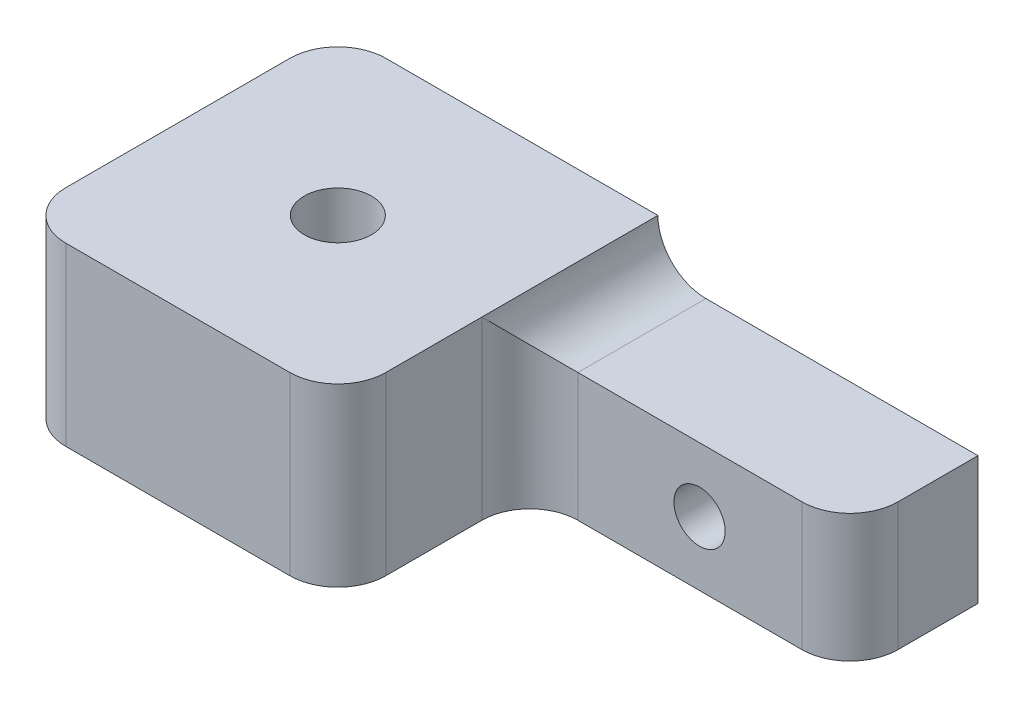
ISO-10303-21;
HEADER;
FILE_DESCRIPTION(('STEP AP214'),'2;1');
FILE_NAME('part.step','',(''),(''),'','','');
FILE_SCHEMA(('AUTOMOTIVE_DESIGN { 1 0 10303 214 1 1 1 1 }'));
ENDSEC;
DATA;
#1=APPLICATION_CONTEXT('core data for automotive mechanical design processes');
#2=APPLICATION_PROTOCOL_DEFINITION('international standard','automotive_design',2000,#1);
#3=PRODUCT_CONTEXT('',#1,'mechanical');
#4=PRODUCT('Part','Part','',(#3));
#5=PRODUCT_RELATED_PRODUCT_CATEGORY('part','',(#4));
#6=PRODUCT_DEFINITION_FORMATION('','',#4);
#7=PRODUCT_DEFINITION_CONTEXT('part definition',#1,'design');
#8=PRODUCT_DEFINITION('design','',#6,#7);
#9=PRODUCT_DEFINITION_SHAPE('','',#8);
#10=(LENGTH_UNIT() NAMED_UNIT(*) SI_UNIT(.MILLI.,.METRE.));
#11=(NAMED_UNIT(*) PLANE_ANGLE_UNIT() SI_UNIT($,.RADIAN.));
#12=(NAMED_UNIT(*) SI_UNIT($,.STERADIAN.) SOLID_ANGLE_UNIT());
#13=UNCERTAINTY_MEASURE_WITH_UNIT(LENGTH_MEASURE(1.E-05),#10,'distance_accuracy_value','');
#14=(GEOMETRIC_REPRESENTATION_CONTEXT(3) GLOBAL_UNCERTAINTY_ASSIGNED_CONTEXT((#13)) GLOBAL_UNIT_ASSIGNED_CONTEXT((#10,
#11,#12)) REPRESENTATION_CONTEXT('',''));
#15=CARTESIAN_POINT('',(0.,0.,0.));
#16=DIRECTION('',(0.,0.,1.));
#17=DIRECTION('',(1.,0.,0.));
#18=AXIS2_PLACEMENT_3D('',#15,#16,#17);
#19=CARTESIAN_POINT('',(0.,8.,8.));
#20=DIRECTION('',(0.,-1.,0.));
#21=DIRECTION('',(0.,0.,-1.));
#22=AXIS2_PLACEMENT_3D('',#19,#20,#21);
#23=PLANE('',#22);
#24=DIRECTION('',(-1.,0.,0.));
#25=VECTOR('',#24,1.);
#26=CARTESIAN_POINT('',(0.,8.,8.));
#27=LINE('',#26,#25);
#28=CARTESIAN_POINT('',(37.,8.,8.));
#29=VERTEX_POINT('',#28);
#30=CARTESIAN_POINT('',(23.,8.,8.));
#31=VERTEX_POINT('',#30);
#32=EDGE_CURVE('E194',#29,#31,#27,.T.);
#33=ORIENTED_EDGE('',*,*,#32,.F.);
#34=CARTESIAN_POINT('',(37.,8.,5.));
#35=DIRECTION('',(0.,-1.,0.));
#36=DIRECTION('',(0.,0.,-1.));
#37=AXIS2_PLACEMENT_3D('',#34,#35,#36);
#38=CIRCLE('',#37,3.);
#39=CARTESIAN_POINT('',(40.,8.,5.));
#40=VERTEX_POINT('',#39);
#41=EDGE_CURVE('E57',#29,#40,#38,.F.);
#42=ORIENTED_EDGE('',*,*,#41,.T.);
#43=DIRECTION('',(0.,0.,-1.));
#44=VECTOR('',#43,1.);
#45=CARTESIAN_POINT('',(40.,8.,8.));
#46=LINE('',#45,#44);
#47=CARTESIAN_POINT('',(40.,8.,0.));
#48=VERTEX_POINT('',#47);
#49=EDGE_CURVE('E205',#40,#48,#46,.T.);
#50=ORIENTED_EDGE('',*,*,#49,.T.);
#51=DIRECTION('',(-1.,0.,0.));
#52=VECTOR('',#51,1.);
#53=CARTESIAN_POINT('',(0.,8.,0.));
#54=LINE('',#53,#52);
#55=CARTESIAN_POINT('',(23.,8.,0.));
#56=VERTEX_POINT('',#55);
#57=EDGE_CURVE('E195',#48,#56,#54,.T.);
#58=ORIENTED_EDGE('',*,*,#57,.T.);
#59=DIRECTION('',(0.,0.,-1.));
#60=VECTOR('',#59,1.);
#61=CARTESIAN_POINT('',(23.,8.,8.));
#62=LINE('',#61,#60);
#63=EDGE_CURVE('E145',#56,#31,#62,.F.);
#64=ORIENTED_EDGE('',*,*,#63,.T.);
#65=EDGE_LOOP('',(#33,#42,#50,#58,#64));
#66=FACE_BOUND('',#65,.T.);
#67=ADVANCED_FACE('F35',(#66),#23,.F.);
#68=CARTESIAN_POINT('',(0.,0.,8.));
#69=DIRECTION('',(0.,0.,-1.));
#70=DIRECTION('',(-1.,0.,0.));
#71=AXIS2_PLACEMENT_3D('',#68,#69,#70);
#72=PLANE('',#71);
#73=CARTESIAN_POINT('',(30.6,4.,8.));
#74=DIRECTION('',(0.,0.,-1.));
#75=DIRECTION('',(-1.,0.,0.));
#76=AXIS2_PLACEMENT_3D('',#73,#74,#75);
#77=CIRCLE('',#76,1.6);
#78=CARTESIAN_POINT('',(29.,4.,8.));
#79=VERTEX_POINT('',#78);
#80=EDGE_CURVE('E430',#79,#79,#77,.T.);
#81=ORIENTED_EDGE('',*,*,#80,.T.);
#82=EDGE_LOOP('',(#81));
#83=FACE_BOUND('',#82,.T.);
#84=DIRECTION('',(1.,0.,0.));
#85=VECTOR('',#84,1.);
#86=CARTESIAN_POINT('',(0.,0.,8.));
#87=LINE('',#86,#85);
#88=CARTESIAN_POINT('',(23.,0.,8.));
#89=VERTEX_POINT('',#88);
#90=CARTESIAN_POINT('',(37.,0.,8.));
#91=VERTEX_POINT('',#90);
#92=EDGE_CURVE('E172',#89,#91,#87,.T.);
#93=ORIENTED_EDGE('',*,*,#92,.T.);
#94=DIRECTION('',(0.,1.,0.));
#95=VECTOR('',#94,1.);
#96=CARTESIAN_POINT('',(37.,0.,8.));
#97=LINE('',#96,#95);
#98=EDGE_CURVE('E147',#91,#29,#97,.T.);
#99=ORIENTED_EDGE('',*,*,#98,.T.);
#100=ORIENTED_EDGE('',*,*,#32,.T.);
#101=DIRECTION('',(0.,1.,0.));
#102=VECTOR('',#101,1.);
#103=CARTESIAN_POINT('',(23.,0.,8.));
#104=LINE('',#103,#102);
#105=EDGE_CURVE('E152',#31,#89,#104,.F.);
#106=ORIENTED_EDGE('',*,*,#105,.T.);
#107=EDGE_LOOP('',(#93,#99,#100,#106));
#108=FACE_BOUND('',#107,.T.);
#109=ADVANCED_FACE('F256',(#83,#108),#72,.F.);
#110=CARTESIAN_POINT('',(0.,0.,8.));
#111=DIRECTION('',(1.,0.,0.));
#112=DIRECTION('',(0.,0.,-1.));
#113=AXIS2_PLACEMENT_3D('',#110,#111,#112);
#114=PLANE('',#113);
#115=DIRECTION('',(0.,0.,1.));
#116=VECTOR('',#115,1.);
#117=CARTESIAN_POINT('',(0.,11.,20.));
#118=LINE('',#117,#116);
#119=CARTESIAN_POINT('',(0.,11.,3.));
#120=VERTEX_POINT('',#119);
#121=CARTESIAN_POINT('',(0.,11.,17.));
#122=VERTEX_POINT('',#121);
#123=EDGE_CURVE('E432',#120,#122,#118,.T.);
#124=ORIENTED_EDGE('',*,*,#123,.F.);
#125=DIRECTION('',(0.,-1.,0.));
#126=VECTOR('',#125,1.);
#127=CARTESIAN_POINT('',(0.,0.,3.));
#128=LINE('',#127,#126);
#129=CARTESIAN_POINT('',(0.,0.,3.));
#130=VERTEX_POINT('',#129);
#131=EDGE_CURVE('E159',#120,#130,#128,.T.);
#132=ORIENTED_EDGE('',*,*,#131,.T.);
#133=DIRECTION('',(0.,0.,-1.));
#134=VECTOR('',#133,1.);
#135=CARTESIAN_POINT('',(0.,0.,8.));
#136=LINE('',#135,#134);
#137=CARTESIAN_POINT('',(0.,0.,17.));
#138=VERTEX_POINT('',#137);
#139=EDGE_CURVE('E218',#138,#130,#136,.T.);
#140=ORIENTED_EDGE('',*,*,#139,.F.);
#141=DIRECTION('',(0.,-1.,0.));
#142=VECTOR('',#141,1.);
#143=CARTESIAN_POINT('',(0.,11.,17.));
#144=LINE('',#143,#142);
#145=EDGE_CURVE('E157',#138,#122,#144,.F.);
#146=ORIENTED_EDGE('',*,*,#145,.T.);
#147=EDGE_LOOP('',(#124,#132,#140,#146));
#148=FACE_BOUND('',#147,.T.);
#149=ADVANCED_FACE('F225',(#148),#114,.F.);
#150=CARTESIAN_POINT('',(0.,0.,8.));
#151=DIRECTION('',(0.,1.,0.));
#152=DIRECTION('',(0.,0.,1.));
#153=AXIS2_PLACEMENT_3D('',#150,#151,#152);
#154=PLANE('',#153);
#155=CARTESIAN_POINT('',(10.,0.,10.));
#156=DIRECTION('',(0.,-1.,0.));
#157=DIRECTION('',(0.,0.,-1.));
#158=AXIS2_PLACEMENT_3D('',#155,#156,#157);
#159=CIRCLE('',#158,2.1);
#160=CARTESIAN_POINT('',(10.,0.,7.9));
#161=VERTEX_POINT('',#160);
#162=EDGE_CURVE('E423',#161,#161,#159,.T.);
#163=ORIENTED_EDGE('',*,*,#162,.F.);
#164=EDGE_LOOP('',(#163));
#165=FACE_BOUND('',#164,.T.);
#166=DIRECTION('',(0.,0.,-1.));
#167=VECTOR('',#166,1.);
#168=CARTESIAN_POINT('',(20.,0.,20.));
#169=LINE('',#168,#167);
#170=CARTESIAN_POINT('',(20.,0.,17.));
#171=VERTEX_POINT('',#170);
#172=CARTESIAN_POINT('',(20.,0.,11.));
#173=VERTEX_POINT('',#172);
#174=EDGE_CURVE('E169',#171,#173,#169,.T.);
#175=ORIENTED_EDGE('',*,*,#174,.F.);
#176=CARTESIAN_POINT('',(17.,0.,17.));
#177=DIRECTION('',(0.,1.,0.));
#178=DIRECTION('',(0.,0.,1.));
#179=AXIS2_PLACEMENT_3D('',#176,#177,#178);
#180=CIRCLE('',#179,3.);
#181=CARTESIAN_POINT('',(17.,0.,20.));
#182=VERTEX_POINT('',#181);
#183=EDGE_CURVE('E206',#171,#182,#180,.F.);
#184=ORIENTED_EDGE('',*,*,#183,.T.);
#185=DIRECTION('',(1.,0.,0.));
#186=VECTOR('',#185,1.);
#187=CARTESIAN_POINT('',(0.,0.,20.));
#188=LINE('',#187,#186);
#189=CARTESIAN_POINT('',(3.,0.,20.));
#190=VERTEX_POINT('',#189);
#191=EDGE_CURVE('E142',#190,#182,#188,.T.);
#192=ORIENTED_EDGE('',*,*,#191,.F.);
#193=CARTESIAN_POINT('',(3.,0.,17.));
#194=DIRECTION('',(0.,1.,0.));
#195=DIRECTION('',(0.,0.,1.));
#196=AXIS2_PLACEMENT_3D('',#193,#194,#195);
#197=CIRCLE('',#196,3.);
#198=EDGE_CURVE('E186',#190,#138,#197,.F.);
#199=ORIENTED_EDGE('',*,*,#198,.T.);
#200=ORIENTED_EDGE('',*,*,#139,.T.);
#201=CARTESIAN_POINT('',(3.,0.,3.));
#202=DIRECTION('',(0.,1.,0.));
#203=DIRECTION('',(0.,0.,1.));
#204=AXIS2_PLACEMENT_3D('',#201,#202,#203);
#205=CIRCLE('',#204,3.);
#206=CARTESIAN_POINT('',(3.,0.,0.));
#207=VERTEX_POINT('',#206);
#208=EDGE_CURVE('E212',#130,#207,#205,.F.);
#209=ORIENTED_EDGE('',*,*,#208,.T.);
#210=DIRECTION('',(1.,0.,0.));
#211=VECTOR('',#210,1.);
#212=CARTESIAN_POINT('',(0.,0.,0.));
#213=LINE('',#212,#211);
#214=CARTESIAN_POINT('',(40.,0.,0.));
#215=VERTEX_POINT('',#214);
#216=EDGE_CURVE('E181',#207,#215,#213,.T.);
#217=ORIENTED_EDGE('',*,*,#216,.T.);
#218=DIRECTION('',(0.,0.,-1.));
#219=VECTOR('',#218,1.);
#220=CARTESIAN_POINT('',(40.,0.,8.));
#221=LINE('',#220,#219);
#222=CARTESIAN_POINT('',(40.,0.,5.));
#223=VERTEX_POINT('',#222);
#224=EDGE_CURVE('E229',#223,#215,#221,.T.);
#225=ORIENTED_EDGE('',*,*,#224,.F.);
#226=CARTESIAN_POINT('',(37.,0.,5.));
#227=DIRECTION('',(0.,1.,0.));
#228=DIRECTION('',(0.,0.,1.));
#229=AXIS2_PLACEMENT_3D('',#226,#227,#228);
#230=CIRCLE('',#229,3.);
#231=EDGE_CURVE('E209',#223,#91,#230,.F.);
#232=ORIENTED_EDGE('',*,*,#231,.T.);
#233=ORIENTED_EDGE('',*,*,#92,.F.);
#234=CARTESIAN_POINT('',(23.,0.,11.));
#235=DIRECTION('',(0.,1.,0.));
#236=DIRECTION('',(0.,0.,1.));
#237=AXIS2_PLACEMENT_3D('',#234,#235,#236);
#238=CIRCLE('',#237,3.);
#239=EDGE_CURVE('E44',#89,#173,#238,.T.);
#240=ORIENTED_EDGE('',*,*,#239,.T.);
#241=EDGE_LOOP('',(#175,#184,#192,#199,#200,#209,#217,#225,#232,#233,#240));
#242=FACE_BOUND('',#241,.T.);
#243=ADVANCED_FACE('F168',(#165,#242),#154,.F.);
#244=CARTESIAN_POINT('',(40.,0.,8.));
#245=DIRECTION('',(-1.,0.,0.));
#246=DIRECTION('',(0.,0.,1.));
#247=AXIS2_PLACEMENT_3D('',#244,#245,#246);
#248=PLANE('',#247);
#249=ORIENTED_EDGE('',*,*,#49,.F.);
#250=DIRECTION('',(0.,1.,0.));
#251=VECTOR('',#250,1.);
#252=CARTESIAN_POINT('',(40.,0.,5.));
#253=LINE('',#252,#251);
#254=EDGE_CURVE('E149',#40,#223,#253,.F.);
#255=ORIENTED_EDGE('',*,*,#254,.T.);
#256=ORIENTED_EDGE('',*,*,#224,.T.);
#257=DIRECTION('',(0.,1.,0.));
#258=VECTOR('',#257,1.);
#259=CARTESIAN_POINT('',(40.,0.,0.));
#260=LINE('',#259,#258);
#261=EDGE_CURVE('E243',#215,#48,#260,.T.);
#262=ORIENTED_EDGE('',*,*,#261,.T.);
#263=EDGE_LOOP('',(#249,#255,#256,#262));
#264=FACE_BOUND('',#263,.T.);
#265=ADVANCED_FACE('F250',(#264),#248,.F.);
#266=CARTESIAN_POINT('',(0.,0.,0.));
#267=DIRECTION('',(0.,0.,-1.));
#268=DIRECTION('',(-1.,0.,0.));
#269=AXIS2_PLACEMENT_3D('',#266,#267,#268);
#270=PLANE('',#269);
#271=CARTESIAN_POINT('',(30.6,4.,0.));
#272=DIRECTION('',(0.,0.,-1.));
#273=DIRECTION('',(-1.,0.,0.));
#274=AXIS2_PLACEMENT_3D('',#271,#272,#273);
#275=CIRCLE('',#274,1.6);
#276=CARTESIAN_POINT('',(29.,4.,0.));
#277=VERTEX_POINT('',#276);
#278=EDGE_CURVE('E425',#277,#277,#275,.T.);
#279=ORIENTED_EDGE('',*,*,#278,.F.);
#280=EDGE_LOOP('',(#279));
#281=FACE_BOUND('',#280,.T.);
#282=ORIENTED_EDGE('',*,*,#216,.F.);
#283=DIRECTION('',(0.,-1.,0.));
#284=VECTOR('',#283,1.);
#285=CARTESIAN_POINT('',(3.,11.,0.));
#286=LINE('',#285,#284);
#287=CARTESIAN_POINT('',(3.,11.,0.));
#288=VERTEX_POINT('',#287);
#289=EDGE_CURVE('E141',#207,#288,#286,.F.);
#290=ORIENTED_EDGE('',*,*,#289,.T.);
#291=DIRECTION('',(-1.,0.,0.));
#292=VECTOR('',#291,1.);
#293=CARTESIAN_POINT('',(0.,11.,0.));
#294=LINE('',#293,#292);
#295=CARTESIAN_POINT('',(20.,11.,0.));
#296=VERTEX_POINT('',#295);
#297=EDGE_CURVE('E129',#296,#288,#294,.T.);
#298=ORIENTED_EDGE('',*,*,#297,.F.);
#299=CARTESIAN_POINT('',(23.,11.,0.));
#300=DIRECTION('',(0.,0.,-1.));
#301=DIRECTION('',(-1.,0.,0.));
#302=AXIS2_PLACEMENT_3D('',#299,#300,#301);
#303=CIRCLE('',#302,3.);
#304=EDGE_CURVE('E11',#296,#56,#303,.F.);
#305=ORIENTED_EDGE('',*,*,#304,.T.);
#306=ORIENTED_EDGE('',*,*,#57,.F.);
#307=ORIENTED_EDGE('',*,*,#261,.F.);
#308=EDGE_LOOP('',(#282,#290,#298,#305,#306,#307));
#309=FACE_BOUND('',#308,.T.);
#310=ADVANCED_FACE('F139',(#281,#309),#270,.T.);
#311=CARTESIAN_POINT('',(20.,8.,20.));
#312=DIRECTION('',(-1.,0.,0.));
#313=DIRECTION('',(0.,0.,1.));
#314=AXIS2_PLACEMENT_3D('',#311,#312,#313);
#315=PLANE('',#314);
#316=DIRECTION('',(0.,0.,-1.));
#317=VECTOR('',#316,1.);
#318=CARTESIAN_POINT('',(20.,11.,20.));
#319=LINE('',#318,#317);
#320=CARTESIAN_POINT('',(20.,11.,17.));
#321=VERTEX_POINT('',#320);
#322=CARTESIAN_POINT('',(20.,11.,11.));
#323=VERTEX_POINT('',#322);
#324=EDGE_CURVE('E132',#321,#323,#319,.T.);
#325=ORIENTED_EDGE('',*,*,#324,.F.);
#326=DIRECTION('',(0.,1.,0.));
#327=VECTOR('',#326,1.);
#328=CARTESIAN_POINT('',(20.,0.,17.));
#329=LINE('',#328,#327);
#330=EDGE_CURVE('E180',#321,#171,#329,.F.);
#331=ORIENTED_EDGE('',*,*,#330,.T.);
#332=ORIENTED_EDGE('',*,*,#174,.T.);
#333=DIRECTION('',(0.,1.,0.));
#334=VECTOR('',#333,1.);
#335=CARTESIAN_POINT('',(20.,8.,11.));
#336=LINE('',#335,#334);
#337=EDGE_CURVE('E178',#173,#323,#336,.T.);
#338=ORIENTED_EDGE('',*,*,#337,.T.);
#339=EDGE_LOOP('',(#325,#331,#332,#338));
#340=FACE_BOUND('',#339,.T.);
#341=ADVANCED_FACE('F177',(#340),#315,.F.);
#342=CARTESIAN_POINT('',(0.,0.,20.));
#343=DIRECTION('',(0.,0.,1.));
#344=DIRECTION('',(1.,0.,0.));
#345=AXIS2_PLACEMENT_3D('',#342,#343,#344);
#346=PLANE('',#345);
#347=ORIENTED_EDGE('',*,*,#191,.T.);
#348=DIRECTION('',(0.,1.,0.));
#349=VECTOR('',#348,1.);
#350=CARTESIAN_POINT('',(17.,11.,20.));
#351=LINE('',#350,#349);
#352=CARTESIAN_POINT('',(17.,11.,20.));
#353=VERTEX_POINT('',#352);
#354=EDGE_CURVE('E235',#182,#353,#351,.T.);
#355=ORIENTED_EDGE('',*,*,#354,.T.);
#356=DIRECTION('',(1.,0.,0.));
#357=VECTOR('',#356,1.);
#358=CARTESIAN_POINT('',(0.,11.,20.));
#359=LINE('',#358,#357);
#360=CARTESIAN_POINT('',(3.,11.,20.));
#361=VERTEX_POINT('',#360);
#362=EDGE_CURVE('E136',#361,#353,#359,.T.);
#363=ORIENTED_EDGE('',*,*,#362,.F.);
#364=DIRECTION('',(0.,-1.,0.));
#365=VECTOR('',#364,1.);
#366=CARTESIAN_POINT('',(3.,0.,20.));
#367=LINE('',#366,#365);
#368=EDGE_CURVE('E228',#361,#190,#367,.T.);
#369=ORIENTED_EDGE('',*,*,#368,.T.);
#370=EDGE_LOOP('',(#347,#355,#363,#369));
#371=FACE_BOUND('',#370,.T.);
#372=ADVANCED_FACE('F323',(#371),#346,.T.);
#373=CARTESIAN_POINT('',(0.,11.,0.));
#374=DIRECTION('',(0.,-1.,0.));
#375=DIRECTION('',(0.,0.,-1.));
#376=AXIS2_PLACEMENT_3D('',#373,#374,#375);
#377=PLANE('',#376);
#378=CARTESIAN_POINT('',(10.,11.,10.));
#379=DIRECTION('',(0.,-1.,0.));
#380=DIRECTION('',(0.,0.,-1.));
#381=AXIS2_PLACEMENT_3D('',#378,#379,#380);
#382=CIRCLE('',#381,2.1);
#383=CARTESIAN_POINT('',(10.,11.,7.9));
#384=VERTEX_POINT('',#383);
#385=EDGE_CURVE('E420',#384,#384,#382,.T.);
#386=ORIENTED_EDGE('',*,*,#385,.T.);
#387=EDGE_LOOP('',(#386));
#388=FACE_BOUND('',#387,.T.);
#389=ORIENTED_EDGE('',*,*,#362,.T.);
#390=CARTESIAN_POINT('',(17.,11.,17.));
#391=DIRECTION('',(0.,-1.,0.));
#392=DIRECTION('',(0.,0.,-1.));
#393=AXIS2_PLACEMENT_3D('',#390,#391,#392);
#394=CIRCLE('',#393,3.);
#395=EDGE_CURVE('E184',#353,#321,#394,.F.);
#396=ORIENTED_EDGE('',*,*,#395,.T.);
#397=ORIENTED_EDGE('',*,*,#324,.T.);
#398=EDGE_CURVE('E126',#323,#296,#319,.T.);
#399=ORIENTED_EDGE('',*,*,#398,.T.);
#400=ORIENTED_EDGE('',*,*,#297,.T.);
#401=CARTESIAN_POINT('',(3.,11.,3.));
#402=DIRECTION('',(0.,-1.,0.));
#403=DIRECTION('',(0.,0.,-1.));
#404=AXIS2_PLACEMENT_3D('',#401,#402,#403);
#405=CIRCLE('',#404,3.);
#406=EDGE_CURVE('E188',#288,#120,#405,.F.);
#407=ORIENTED_EDGE('',*,*,#406,.T.);
#408=ORIENTED_EDGE('',*,*,#123,.T.);
#409=CARTESIAN_POINT('',(3.,11.,17.));
#410=DIRECTION('',(0.,-1.,0.));
#411=DIRECTION('',(0.,0.,-1.));
#412=AXIS2_PLACEMENT_3D('',#409,#410,#411);
#413=CIRCLE('',#412,3.);
#414=EDGE_CURVE('E233',#122,#361,#413,.F.);
#415=ORIENTED_EDGE('',*,*,#414,.T.);
#416=EDGE_LOOP('',(#389,#396,#397,#399,#400,#407,#408,#415));
#417=FACE_BOUND('',#416,.T.);
#418=ADVANCED_FACE('F128',(#388,#417),#377,.F.);
#419=CARTESIAN_POINT('',(17.,0.,17.));
#420=DIRECTION('',(0.,-1.,0.));
#421=DIRECTION('',(0.,0.,-1.));
#422=AXIS2_PLACEMENT_3D('',#419,#420,#421);
#423=CYLINDRICAL_SURFACE('',#422,3.);
#424=ORIENTED_EDGE('',*,*,#183,.F.);
#425=ORIENTED_EDGE('',*,*,#330,.F.);
#426=ORIENTED_EDGE('',*,*,#395,.F.);
#427=ORIENTED_EDGE('',*,*,#354,.F.);
#428=EDGE_LOOP('',(#424,#425,#426,#427));
#429=FACE_BOUND('',#428,.T.);
#430=ADVANCED_FACE('F278',(#429),#423,.T.);
#431=CARTESIAN_POINT('',(37.,0.,5.));
#432=DIRECTION('',(0.,1.,0.));
#433=DIRECTION('',(0.,0.,1.));
#434=AXIS2_PLACEMENT_3D('',#431,#432,#433);
#435=CYLINDRICAL_SURFACE('',#434,3.);
#436=ORIENTED_EDGE('',*,*,#231,.F.);
#437=ORIENTED_EDGE('',*,*,#254,.F.);
#438=ORIENTED_EDGE('',*,*,#41,.F.);
#439=ORIENTED_EDGE('',*,*,#98,.F.);
#440=EDGE_LOOP('',(#436,#437,#438,#439));
#441=FACE_BOUND('',#440,.T.);
#442=ADVANCED_FACE('F254',(#441),#435,.T.);
#443=CARTESIAN_POINT('',(3.,0.,3.));
#444=DIRECTION('',(0.,1.,0.));
#445=DIRECTION('',(0.,0.,1.));
#446=AXIS2_PLACEMENT_3D('',#443,#444,#445);
#447=CYLINDRICAL_SURFACE('',#446,3.);
#448=ORIENTED_EDGE('',*,*,#406,.F.);
#449=ORIENTED_EDGE('',*,*,#289,.F.);
#450=ORIENTED_EDGE('',*,*,#208,.F.);
#451=ORIENTED_EDGE('',*,*,#131,.F.);
#452=EDGE_LOOP('',(#448,#449,#450,#451));
#453=FACE_BOUND('',#452,.T.);
#454=ADVANCED_FACE('F284',(#453),#447,.T.);
#455=CARTESIAN_POINT('',(3.,0.,17.));
#456=DIRECTION('',(0.,1.,0.));
#457=DIRECTION('',(0.,0.,1.));
#458=AXIS2_PLACEMENT_3D('',#455,#456,#457);
#459=CYLINDRICAL_SURFACE('',#458,3.);
#460=ORIENTED_EDGE('',*,*,#414,.F.);
#461=ORIENTED_EDGE('',*,*,#145,.F.);
#462=ORIENTED_EDGE('',*,*,#198,.F.);
#463=ORIENTED_EDGE('',*,*,#368,.F.);
#464=EDGE_LOOP('',(#460,#461,#462,#463));
#465=FACE_BOUND('',#464,.T.);
#466=ADVANCED_FACE('F232',(#465),#459,.T.);
#467=CARTESIAN_POINT('',(23.,11.,20.));
#468=DIRECTION('',(0.,0.,1.));
#469=DIRECTION('',(1.,0.,0.));
#470=AXIS2_PLACEMENT_3D('',#467,#468,#469);
#471=CYLINDRICAL_SURFACE('',#470,3.);
#472=ORIENTED_EDGE('',*,*,#304,.F.);
#473=ORIENTED_EDGE('',*,*,#398,.F.);
#474=CARTESIAN_POINT('',(23.,11.,11.));
#475=DIRECTION('',(0.,-0.707106781186547,0.707106781186547));
#476=DIRECTION('',(0.,0.707106781186547,0.707106781186547));
#477=AXIS2_PLACEMENT_3D('',#474,#475,#476);
#478=ELLIPSE('',#477,4.24264068711928,3.);
#479=EDGE_CURVE('E39',#31,#323,#478,.F.);
#480=ORIENTED_EDGE('',*,*,#479,.F.);
#481=ORIENTED_EDGE('',*,*,#63,.F.);
#482=EDGE_LOOP('',(#472,#473,#480,#481));
#483=FACE_BOUND('',#482,.T.);
#484=ADVANCED_FACE('F37',(#483),#471,.F.);
#485=CARTESIAN_POINT('',(23.,8.,11.));
#486=DIRECTION('',(0.,-1.,0.));
#487=DIRECTION('',(0.,0.,-1.));
#488=AXIS2_PLACEMENT_3D('',#485,#486,#487);
#489=CYLINDRICAL_SURFACE('',#488,3.);
#490=ORIENTED_EDGE('',*,*,#239,.F.);
#491=ORIENTED_EDGE('',*,*,#105,.F.);
#492=ORIENTED_EDGE('',*,*,#479,.T.);
#493=ORIENTED_EDGE('',*,*,#337,.F.);
#494=EDGE_LOOP('',(#490,#491,#492,#493));
#495=FACE_BOUND('',#494,.T.);
#496=ADVANCED_FACE('F183',(#495),#489,.F.);
#497=CARTESIAN_POINT('',(30.6,4.,20.));
#498=DIRECTION('',(0.,0.,-1.));
#499=DIRECTION('',(-1.,0.,0.));
#500=AXIS2_PLACEMENT_3D('',#497,#498,#499);
#501=CYLINDRICAL_SURFACE('',#500,1.6);
#502=ORIENTED_EDGE('',*,*,#278,.T.);
#503=EDGE_LOOP('',(#502));
#504=FACE_BOUND('',#503,.T.);
#505=ORIENTED_EDGE('',*,*,#80,.F.);
#506=EDGE_LOOP('',(#505));
#507=FACE_BOUND('',#506,.T.);
#508=ADVANCED_FACE('F290',(#504,#507),#501,.F.);
#509=CARTESIAN_POINT('',(10.,11.,10.));
#510=DIRECTION('',(0.,-1.,0.));
#511=DIRECTION('',(0.,0.,-1.));
#512=AXIS2_PLACEMENT_3D('',#509,#510,#511);
#513=CYLINDRICAL_SURFACE('',#512,2.1);
#514=ORIENTED_EDGE('',*,*,#385,.F.);
#515=EDGE_LOOP('',(#514));
#516=FACE_BOUND('',#515,.T.);
#517=ORIENTED_EDGE('',*,*,#162,.T.);
#518=EDGE_LOOP('',(#517));
#519=FACE_BOUND('',#518,.T.);
#520=ADVANCED_FACE('F295',(#516,#519),#513,.F.);
#521=CLOSED_SHELL('',(#67,#109,#149,#243,#265,#310,#341,#372,#418,#430,#442,#454,#466,#484,#496,
#508,#520));
#522=MANIFOLD_SOLID_BREP('B2',#521);
#523=ADVANCED_BREP_SHAPE_REPRESENTATION('',(#18,#522),#14);
#524=SHAPE_DEFINITION_REPRESENTATION(#9,#523);
ENDSEC;
END-ISO-10303-21;
